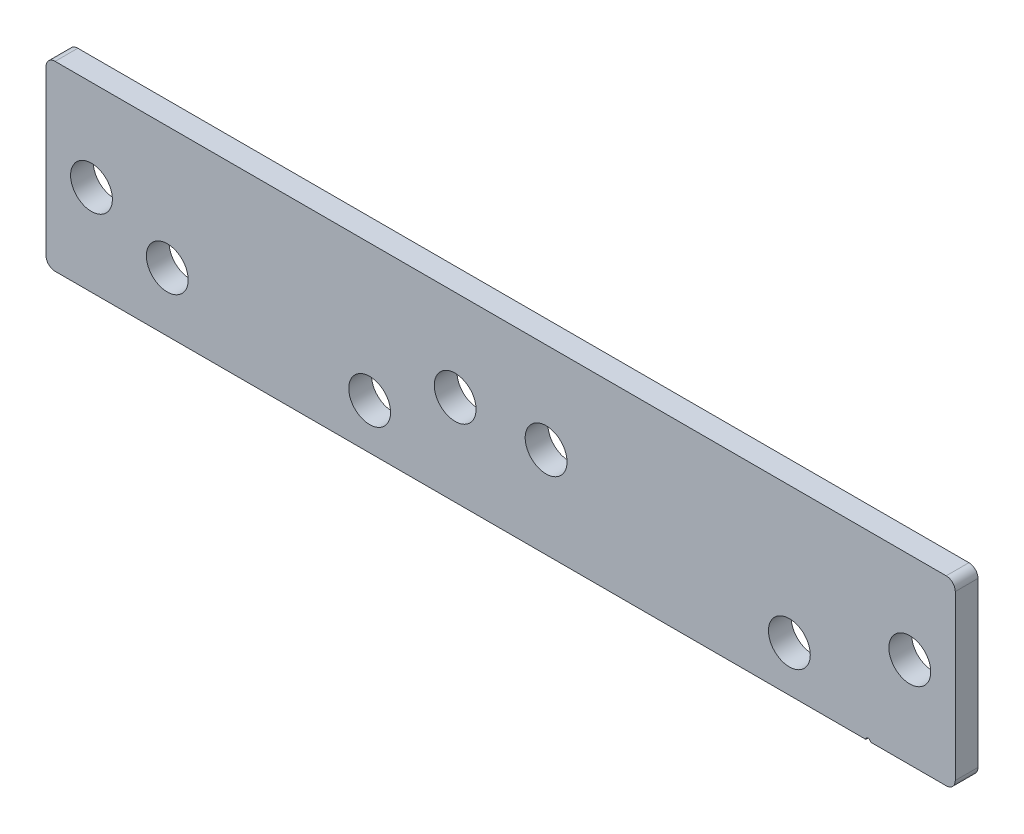
ISO-10303-21;
HEADER;
FILE_DESCRIPTION(('STEP AP214'),'2;1');
FILE_NAME('part.step','',(''),(''),'','','');
FILE_SCHEMA(('AUTOMOTIVE_DESIGN { 1 0 10303 214 1 1 1 1 }'));
ENDSEC;
DATA;
#1=APPLICATION_CONTEXT('core data for automotive mechanical design processes');
#2=APPLICATION_PROTOCOL_DEFINITION('international standard','automotive_design',2000,#1);
#3=PRODUCT_CONTEXT('',#1,'mechanical');
#4=PRODUCT('Part','Part','',(#3));
#5=PRODUCT_RELATED_PRODUCT_CATEGORY('part','',(#4));
#6=PRODUCT_DEFINITION_FORMATION('','',#4);
#7=PRODUCT_DEFINITION_CONTEXT('part definition',#1,'design');
#8=PRODUCT_DEFINITION('design','',#6,#7);
#9=PRODUCT_DEFINITION_SHAPE('','',#8);
#10=(LENGTH_UNIT() NAMED_UNIT(*) SI_UNIT(.MILLI.,.METRE.));
#11=(NAMED_UNIT(*) PLANE_ANGLE_UNIT() SI_UNIT($,.RADIAN.));
#12=(NAMED_UNIT(*) SI_UNIT($,.STERADIAN.) SOLID_ANGLE_UNIT());
#13=UNCERTAINTY_MEASURE_WITH_UNIT(LENGTH_MEASURE(1.E-05),#10,'distance_accuracy_value','');
#14=(GEOMETRIC_REPRESENTATION_CONTEXT(3) GLOBAL_UNCERTAINTY_ASSIGNED_CONTEXT((#13)) GLOBAL_UNIT_ASSIGNED_CONTEXT((#10,
#11,#12)) REPRESENTATION_CONTEXT('',''));
#15=CARTESIAN_POINT('',(0.,0.,0.));
#16=DIRECTION('',(0.,0.,1.));
#17=DIRECTION('',(1.,0.,0.));
#18=AXIS2_PLACEMENT_3D('',#15,#16,#17);
#19=CARTESIAN_POINT('',(-100.,-20.,5.));
#20=DIRECTION('',(0.,1.,0.));
#21=DIRECTION('',(-1.,0.,0.));
#22=AXIS2_PLACEMENT_3D('',#19,#20,#21);
#23=PLANE('',#22);
#24=DIRECTION('',(1.,0.,0.));
#25=VECTOR('',#24,1.);
#26=CARTESIAN_POINT('',(-100.,-20.,5.));
#27=LINE('',#26,#25);
#28=CARTESIAN_POINT('',(81.3290376865422,-20.,5.));
#29=VERTEX_POINT('',#28);
#30=CARTESIAN_POINT('',(98.,-19.9999999999999,5.));
#31=VERTEX_POINT('',#30);
#32=EDGE_CURVE('E41',#29,#31,#27,.T.);
#33=ORIENTED_EDGE('',*,*,#32,.F.);
#34=DIRECTION('',(0.,0.,-1.));
#35=VECTOR('',#34,1.);
#36=CARTESIAN_POINT('',(81.3290376865422,-20.,5.));
#37=LINE('',#36,#35);
#38=CARTESIAN_POINT('',(81.3290376865422,-20.,0.));
#39=VERTEX_POINT('',#38);
#40=EDGE_CURVE('E96',#29,#39,#37,.T.);
#41=ORIENTED_EDGE('',*,*,#40,.T.);
#42=DIRECTION('',(1.,0.,0.));
#43=VECTOR('',#42,1.);
#44=CARTESIAN_POINT('',(-100.,-20.,0.));
#45=LINE('',#44,#43);
#46=CARTESIAN_POINT('',(98.,-19.9999999999999,0.));
#47=VERTEX_POINT('',#46);
#48=EDGE_CURVE('E130',#39,#47,#45,.T.);
#49=ORIENTED_EDGE('',*,*,#48,.T.);
#50=DIRECTION('',(0.,0.,-1.));
#51=VECTOR('',#50,1.);
#52=CARTESIAN_POINT('',(98.,-19.9999999999999,5.));
#53=LINE('',#52,#51);
#54=EDGE_CURVE('E166',#47,#31,#53,.F.);
#55=ORIENTED_EDGE('',*,*,#54,.T.);
#56=EDGE_LOOP('',(#33,#41,#49,#55));
#57=FACE_BOUND('',#56,.T.);
#58=ADVANCED_FACE('F16',(#57),#23,.F.);
#59=CARTESIAN_POINT('',(-100.,20.,5.));
#60=DIRECTION('',(1.,0.,0.));
#61=DIRECTION('',(0.,1.,0.));
#62=AXIS2_PLACEMENT_3D('',#59,#60,#61);
#63=PLANE('',#62);
#64=DIRECTION('',(0.,-1.,0.));
#65=VECTOR('',#64,1.);
#66=CARTESIAN_POINT('',(-100.,20.,5.));
#67=LINE('',#66,#65);
#68=CARTESIAN_POINT('',(-100.,18.,5.));
#69=VERTEX_POINT('',#68);
#70=CARTESIAN_POINT('',(-100.,-18.,5.));
#71=VERTEX_POINT('',#70);
#72=EDGE_CURVE('E120',#69,#71,#67,.T.);
#73=ORIENTED_EDGE('',*,*,#72,.F.);
#74=DIRECTION('',(0.,0.,-1.));
#75=VECTOR('',#74,1.);
#76=CARTESIAN_POINT('',(-100.,18.,5.));
#77=LINE('',#76,#75);
#78=CARTESIAN_POINT('',(-100.,18.,0.));
#79=VERTEX_POINT('',#78);
#80=EDGE_CURVE('E10',#69,#79,#77,.T.);
#81=ORIENTED_EDGE('',*,*,#80,.T.);
#82=DIRECTION('',(0.,-1.,0.));
#83=VECTOR('',#82,1.);
#84=CARTESIAN_POINT('',(-100.,20.,0.));
#85=LINE('',#84,#83);
#86=CARTESIAN_POINT('',(-100.,-18.,0.));
#87=VERTEX_POINT('',#86);
#88=EDGE_CURVE('E127',#79,#87,#85,.T.);
#89=ORIENTED_EDGE('',*,*,#88,.T.);
#90=DIRECTION('',(0.,0.,-1.));
#91=VECTOR('',#90,1.);
#92=CARTESIAN_POINT('',(-100.,-18.,5.));
#93=LINE('',#92,#91);
#94=EDGE_CURVE('E25',#87,#71,#93,.F.);
#95=ORIENTED_EDGE('',*,*,#94,.T.);
#96=EDGE_LOOP('',(#73,#81,#89,#95));
#97=FACE_BOUND('',#96,.T.);
#98=ADVANCED_FACE('F244',(#97),#63,.F.);
#99=CARTESIAN_POINT('',(-98.,-20.,0.));
#100=VERTEX_POINT('',#99);
#101=CARTESIAN_POINT('',(80.3290376865422,-20.,0.));
#102=VERTEX_POINT('',#101);
#103=EDGE_CURVE('E108',#100,#102,#45,.T.);
#104=ORIENTED_EDGE('',*,*,#103,.T.);
#105=DIRECTION('',(0.,0.,-1.));
#106=VECTOR('',#105,1.);
#107=CARTESIAN_POINT('',(80.3290376865422,-20.,5.));
#108=LINE('',#107,#106);
#109=CARTESIAN_POINT('',(80.3290376865422,-20.,5.));
#110=VERTEX_POINT('',#109);
#111=EDGE_CURVE('E33',#102,#110,#108,.F.);
#112=ORIENTED_EDGE('',*,*,#111,.T.);
#113=CARTESIAN_POINT('',(-98.,-20.,5.));
#114=VERTEX_POINT('',#113);
#115=EDGE_CURVE('E105',#114,#110,#27,.T.);
#116=ORIENTED_EDGE('',*,*,#115,.F.);
#117=DIRECTION('',(0.,0.,-1.));
#118=VECTOR('',#117,1.);
#119=CARTESIAN_POINT('',(-98.,-20.,5.));
#120=LINE('',#119,#118);
#121=EDGE_CURVE('E164',#114,#100,#120,.T.);
#122=ORIENTED_EDGE('',*,*,#121,.T.);
#123=EDGE_LOOP('',(#104,#112,#116,#122));
#124=FACE_BOUND('',#123,.T.);
#125=ADVANCED_FACE('F103',(#124),#23,.F.);
#126=CARTESIAN_POINT('',(100.,20.,5.));
#127=DIRECTION('',(-1.,0.,0.));
#128=DIRECTION('',(0.,0.,1.));
#129=AXIS2_PLACEMENT_3D('',#126,#127,#128);
#130=PLANE('',#129);
#131=DIRECTION('',(0.,1.,0.));
#132=VECTOR('',#131,1.);
#133=CARTESIAN_POINT('',(100.,20.,0.));
#134=LINE('',#133,#132);
#135=CARTESIAN_POINT('',(100.,-18.,0.));
#136=VERTEX_POINT('',#135);
#137=CARTESIAN_POINT('',(100.,18.,0.));
#138=VERTEX_POINT('',#137);
#139=EDGE_CURVE('E133',#136,#138,#134,.T.);
#140=ORIENTED_EDGE('',*,*,#139,.T.);
#141=DIRECTION('',(0.,0.,-1.));
#142=VECTOR('',#141,1.);
#143=CARTESIAN_POINT('',(100.,18.,5.));
#144=LINE('',#143,#142);
#145=CARTESIAN_POINT('',(100.,18.,5.));
#146=VERTEX_POINT('',#145);
#147=EDGE_CURVE('E155',#138,#146,#144,.F.);
#148=ORIENTED_EDGE('',*,*,#147,.T.);
#149=DIRECTION('',(0.,1.,0.));
#150=VECTOR('',#149,1.);
#151=CARTESIAN_POINT('',(100.,20.,5.));
#152=LINE('',#151,#150);
#153=CARTESIAN_POINT('',(100.,-18.,5.));
#154=VERTEX_POINT('',#153);
#155=EDGE_CURVE('E115',#154,#146,#152,.T.);
#156=ORIENTED_EDGE('',*,*,#155,.F.);
#157=DIRECTION('',(0.,0.,-1.));
#158=VECTOR('',#157,1.);
#159=CARTESIAN_POINT('',(100.,-18.,5.));
#160=LINE('',#159,#158);
#161=EDGE_CURVE('E152',#154,#136,#160,.T.);
#162=ORIENTED_EDGE('',*,*,#161,.T.);
#163=EDGE_LOOP('',(#140,#148,#156,#162));
#164=FACE_BOUND('',#163,.T.);
#165=ADVANCED_FACE('F228',(#164),#130,.F.);
#166=CARTESIAN_POINT('',(-100.,20.,5.));
#167=DIRECTION('',(0.,-1.,0.));
#168=DIRECTION('',(1.,0.,0.));
#169=AXIS2_PLACEMENT_3D('',#166,#167,#168);
#170=PLANE('',#169);
#171=DIRECTION('',(-1.,0.,0.));
#172=VECTOR('',#171,1.);
#173=CARTESIAN_POINT('',(-100.,20.,5.));
#174=LINE('',#173,#172);
#175=CARTESIAN_POINT('',(98.,20.,5.));
#176=VERTEX_POINT('',#175);
#177=CARTESIAN_POINT('',(-98.,20.,5.));
#178=VERTEX_POINT('',#177);
#179=EDGE_CURVE('E118',#176,#178,#174,.T.);
#180=ORIENTED_EDGE('',*,*,#179,.F.);
#181=DIRECTION('',(0.,0.,-1.));
#182=VECTOR('',#181,1.);
#183=CARTESIAN_POINT('',(98.,20.,5.));
#184=LINE('',#183,#182);
#185=CARTESIAN_POINT('',(98.,20.,0.));
#186=VERTEX_POINT('',#185);
#187=EDGE_CURVE('E140',#176,#186,#184,.T.);
#188=ORIENTED_EDGE('',*,*,#187,.T.);
#189=DIRECTION('',(-1.,0.,0.));
#190=VECTOR('',#189,1.);
#191=CARTESIAN_POINT('',(-100.,20.,0.));
#192=LINE('',#191,#190);
#193=CARTESIAN_POINT('',(-98.,20.,0.));
#194=VERTEX_POINT('',#193);
#195=EDGE_CURVE('E136',#186,#194,#192,.T.);
#196=ORIENTED_EDGE('',*,*,#195,.T.);
#197=DIRECTION('',(0.,0.,-1.));
#198=VECTOR('',#197,1.);
#199=CARTESIAN_POINT('',(-98.,20.,5.));
#200=LINE('',#199,#198);
#201=EDGE_CURVE('E126',#194,#178,#200,.F.);
#202=ORIENTED_EDGE('',*,*,#201,.T.);
#203=EDGE_LOOP('',(#180,#188,#196,#202));
#204=FACE_BOUND('',#203,.T.);
#205=ADVANCED_FACE('F236',(#204),#170,.F.);
#206=CARTESIAN_POINT('',(0.,0.,5.));
#207=DIRECTION('',(0.,0.,1.));
#208=DIRECTION('',(1.,0.,0.));
#209=AXIS2_PLACEMENT_3D('',#206,#207,#208);
#210=PLANE('',#209);
#211=CARTESIAN_POINT('',(-9.99999999999999,0.,5.));
#212=DIRECTION('',(0.,0.,1.));
#213=DIRECTION('',(1.,0.,0.));
#214=AXIS2_PLACEMENT_3D('',#211,#212,#213);
#215=CIRCLE('',#214,4.6);
#216=CARTESIAN_POINT('',(-5.4,0.,5.));
#217=VERTEX_POINT('',#216);
#218=EDGE_CURVE('E176',#217,#217,#215,.T.);
#219=ORIENTED_EDGE('',*,*,#218,.F.);
#220=EDGE_LOOP('',(#219));
#221=FACE_BOUND('',#220,.T.);
#222=CARTESIAN_POINT('',(10.,0.,5.));
#223=DIRECTION('',(0.,0.,1.));
#224=DIRECTION('',(1.,0.,0.));
#225=AXIS2_PLACEMENT_3D('',#222,#223,#224);
#226=CIRCLE('',#225,4.6);
#227=CARTESIAN_POINT('',(14.6,0.,5.));
#228=VERTEX_POINT('',#227);
#229=EDGE_CURVE('E303',#228,#228,#226,.T.);
#230=ORIENTED_EDGE('',*,*,#229,.F.);
#231=EDGE_LOOP('',(#230));
#232=FACE_BOUND('',#231,.T.);
#233=CARTESIAN_POINT('',(90.,0.,5.));
#234=DIRECTION('',(0.,0.,1.));
#235=DIRECTION('',(1.,0.,0.));
#236=AXIS2_PLACEMENT_3D('',#233,#234,#235);
#237=CIRCLE('',#236,4.60000000000001);
#238=CARTESIAN_POINT('',(94.6,0.,5.));
#239=VERTEX_POINT('',#238);
#240=EDGE_CURVE('E188',#239,#239,#237,.T.);
#241=ORIENTED_EDGE('',*,*,#240,.F.);
#242=EDGE_LOOP('',(#241));
#243=FACE_BOUND('',#242,.T.);
#244=CARTESIAN_POINT('',(-90.,0.,5.));
#245=DIRECTION('',(0.,0.,1.));
#246=DIRECTION('',(1.,0.,0.));
#247=AXIS2_PLACEMENT_3D('',#244,#245,#246);
#248=CIRCLE('',#247,4.6);
#249=CARTESIAN_POINT('',(-85.4,0.,5.));
#250=VERTEX_POINT('',#249);
#251=EDGE_CURVE('E172',#250,#250,#248,.T.);
#252=ORIENTED_EDGE('',*,*,#251,.F.);
#253=EDGE_LOOP('',(#252));
#254=FACE_BOUND('',#253,.T.);
#255=CARTESIAN_POINT('',(80.8290376865422,-20.,5.));
#256=DIRECTION('',(0.,0.,-1.));
#257=DIRECTION('',(-1.,0.,0.));
#258=AXIS2_PLACEMENT_3D('',#255,#256,#257);
#259=CIRCLE('',#258,0.499999999999999);
#260=EDGE_CURVE('E93',#110,#29,#259,.T.);
#261=ORIENTED_EDGE('',*,*,#260,.T.);
#262=ORIENTED_EDGE('',*,*,#32,.T.);
#263=CARTESIAN_POINT('',(98.,-18.,5.));
#264=DIRECTION('',(0.,0.,1.));
#265=DIRECTION('',(1.,0.,0.));
#266=AXIS2_PLACEMENT_3D('',#263,#264,#265);
#267=CIRCLE('',#266,2.);
#268=EDGE_CURVE('E160',#31,#154,#267,.T.);
#269=ORIENTED_EDGE('',*,*,#268,.T.);
#270=ORIENTED_EDGE('',*,*,#155,.T.);
#271=CARTESIAN_POINT('',(98.,18.,5.));
#272=DIRECTION('',(0.,0.,1.));
#273=DIRECTION('',(1.,0.,0.));
#274=AXIS2_PLACEMENT_3D('',#271,#272,#273);
#275=CIRCLE('',#274,2.);
#276=EDGE_CURVE('E162',#146,#176,#275,.T.);
#277=ORIENTED_EDGE('',*,*,#276,.T.);
#278=ORIENTED_EDGE('',*,*,#179,.T.);
#279=CARTESIAN_POINT('',(-98.,18.,5.));
#280=DIRECTION('',(0.,0.,1.));
#281=DIRECTION('',(1.,0.,0.));
#282=AXIS2_PLACEMENT_3D('',#279,#280,#281);
#283=CIRCLE('',#282,2.);
#284=EDGE_CURVE('E158',#178,#69,#283,.T.);
#285=ORIENTED_EDGE('',*,*,#284,.T.);
#286=ORIENTED_EDGE('',*,*,#72,.T.);
#287=CARTESIAN_POINT('',(-98.,-18.,5.));
#288=DIRECTION('',(0.,0.,1.));
#289=DIRECTION('',(1.,0.,0.));
#290=AXIS2_PLACEMENT_3D('',#287,#288,#289);
#291=CIRCLE('',#290,2.);
#292=EDGE_CURVE('E114',#71,#114,#291,.T.);
#293=ORIENTED_EDGE('',*,*,#292,.T.);
#294=ORIENTED_EDGE('',*,*,#115,.T.);
#295=EDGE_LOOP('',(#261,#262,#269,#270,#277,#278,#285,#286,#293,#294));
#296=FACE_BOUND('',#295,.T.);
#297=CARTESIAN_POINT('',(63.5085296108533,-10.,5.));
#298=DIRECTION('',(0.,0.,1.));
#299=DIRECTION('',(1.,0.,0.));
#300=AXIS2_PLACEMENT_3D('',#297,#298,#299);
#301=CIRCLE('',#300,4.60000000000001);
#302=CARTESIAN_POINT('',(68.1085296108533,-10.,5.));
#303=VERTEX_POINT('',#302);
#304=EDGE_CURVE('E194',#303,#303,#301,.T.);
#305=ORIENTED_EDGE('',*,*,#304,.F.);
#306=EDGE_LOOP('',(#305));
#307=FACE_BOUND('',#306,.T.);
#308=CARTESIAN_POINT('',(-28.8062077539679,-10.,5.));
#309=DIRECTION('',(0.,0.,1.));
#310=DIRECTION('',(1.,0.,0.));
#311=AXIS2_PLACEMENT_3D('',#308,#309,#310);
#312=CIRCLE('',#311,4.6);
#313=CARTESIAN_POINT('',(-24.2062077539679,-10.,5.));
#314=VERTEX_POINT('',#313);
#315=EDGE_CURVE('E193',#314,#314,#312,.T.);
#316=ORIENTED_EDGE('',*,*,#315,.F.);
#317=EDGE_LOOP('',(#316));
#318=FACE_BOUND('',#317,.T.);
#319=CARTESIAN_POINT('',(-73.3234841870881,-7.00000000000003,5.));
#320=DIRECTION('',(0.,0.,1.));
#321=DIRECTION('',(1.,0.,0.));
#322=AXIS2_PLACEMENT_3D('',#319,#320,#321);
#323=CIRCLE('',#322,4.6);
#324=CARTESIAN_POINT('',(-68.7234841870881,-7.00000000000003,5.));
#325=VERTEX_POINT('',#324);
#326=EDGE_CURVE('E201',#325,#325,#323,.T.);
#327=ORIENTED_EDGE('',*,*,#326,.F.);
#328=EDGE_LOOP('',(#327));
#329=FACE_BOUND('',#328,.T.);
#330=ADVANCED_FACE('F110',(#221,#232,#243,#254,#296,#307,#318,#329),#210,.T.);
#331=CARTESIAN_POINT('',(0.,0.,0.));
#332=DIRECTION('',(0.,0.,1.));
#333=DIRECTION('',(1.,0.,0.));
#334=AXIS2_PLACEMENT_3D('',#331,#332,#333);
#335=PLANE('',#334);
#336=CARTESIAN_POINT('',(-9.99999999999999,0.,0.));
#337=DIRECTION('',(0.,0.,1.));
#338=DIRECTION('',(1.,0.,0.));
#339=AXIS2_PLACEMENT_3D('',#336,#337,#338);
#340=CIRCLE('',#339,4.6);
#341=CARTESIAN_POINT('',(-5.4,0.,0.));
#342=VERTEX_POINT('',#341);
#343=EDGE_CURVE('E20',#342,#342,#340,.T.);
#344=ORIENTED_EDGE('',*,*,#343,.T.);
#345=EDGE_LOOP('',(#344));
#346=FACE_BOUND('',#345,.T.);
#347=CARTESIAN_POINT('',(10.,0.,0.));
#348=DIRECTION('',(0.,0.,1.));
#349=DIRECTION('',(1.,0.,0.));
#350=AXIS2_PLACEMENT_3D('',#347,#348,#349);
#351=CIRCLE('',#350,4.6);
#352=CARTESIAN_POINT('',(14.6,0.,0.));
#353=VERTEX_POINT('',#352);
#354=EDGE_CURVE('E175',#353,#353,#351,.T.);
#355=ORIENTED_EDGE('',*,*,#354,.T.);
#356=EDGE_LOOP('',(#355));
#357=FACE_BOUND('',#356,.T.);
#358=CARTESIAN_POINT('',(90.,0.,0.));
#359=DIRECTION('',(0.,0.,1.));
#360=DIRECTION('',(1.,0.,0.));
#361=AXIS2_PLACEMENT_3D('',#358,#359,#360);
#362=CIRCLE('',#361,4.60000000000001);
#363=CARTESIAN_POINT('',(94.6,0.,0.));
#364=VERTEX_POINT('',#363);
#365=EDGE_CURVE('E173',#364,#364,#362,.T.);
#366=ORIENTED_EDGE('',*,*,#365,.T.);
#367=EDGE_LOOP('',(#366));
#368=FACE_BOUND('',#367,.T.);
#369=CARTESIAN_POINT('',(-90.,0.,0.));
#370=DIRECTION('',(0.,0.,1.));
#371=DIRECTION('',(1.,0.,0.));
#372=AXIS2_PLACEMENT_3D('',#369,#370,#371);
#373=CIRCLE('',#372,4.6);
#374=CARTESIAN_POINT('',(-85.4,0.,0.));
#375=VERTEX_POINT('',#374);
#376=EDGE_CURVE('E169',#375,#375,#373,.T.);
#377=ORIENTED_EDGE('',*,*,#376,.T.);
#378=EDGE_LOOP('',(#377));
#379=FACE_BOUND('',#378,.T.);
#380=CARTESIAN_POINT('',(63.5085296108533,-10.,0.));
#381=DIRECTION('',(0.,0.,1.));
#382=DIRECTION('',(1.,0.,0.));
#383=AXIS2_PLACEMENT_3D('',#380,#381,#382);
#384=CIRCLE('',#383,4.60000000000001);
#385=CARTESIAN_POINT('',(68.1085296108533,-10.,0.));
#386=VERTEX_POINT('',#385);
#387=EDGE_CURVE('E197',#386,#386,#384,.F.);
#388=ORIENTED_EDGE('',*,*,#387,.F.);
#389=EDGE_LOOP('',(#388));
#390=FACE_BOUND('',#389,.T.);
#391=CARTESIAN_POINT('',(-28.8062077539679,-10.,0.));
#392=DIRECTION('',(0.,0.,1.));
#393=DIRECTION('',(1.,0.,0.));
#394=AXIS2_PLACEMENT_3D('',#391,#392,#393);
#395=CIRCLE('',#394,4.6);
#396=CARTESIAN_POINT('',(-24.2062077539679,-10.,0.));
#397=VERTEX_POINT('',#396);
#398=EDGE_CURVE('E198',#397,#397,#395,.F.);
#399=ORIENTED_EDGE('',*,*,#398,.F.);
#400=EDGE_LOOP('',(#399));
#401=FACE_BOUND('',#400,.T.);
#402=CARTESIAN_POINT('',(-73.3234841870881,-7.00000000000003,0.));
#403=DIRECTION('',(0.,0.,1.));
#404=DIRECTION('',(1.,0.,0.));
#405=AXIS2_PLACEMENT_3D('',#402,#403,#404);
#406=CIRCLE('',#405,4.6);
#407=CARTESIAN_POINT('',(-68.7234841870881,-7.00000000000003,0.));
#408=VERTEX_POINT('',#407);
#409=EDGE_CURVE('E131',#408,#408,#406,.F.);
#410=ORIENTED_EDGE('',*,*,#409,.F.);
#411=EDGE_LOOP('',(#410));
#412=FACE_BOUND('',#411,.T.);
#413=ORIENTED_EDGE('',*,*,#48,.F.);
#414=CARTESIAN_POINT('',(80.8290376865422,-20.,0.));
#415=DIRECTION('',(0.,0.,-1.));
#416=DIRECTION('',(-1.,0.,0.));
#417=AXIS2_PLACEMENT_3D('',#414,#415,#416);
#418=CIRCLE('',#417,0.499999999999999);
#419=EDGE_CURVE('E98',#102,#39,#418,.T.);
#420=ORIENTED_EDGE('',*,*,#419,.F.);
#421=ORIENTED_EDGE('',*,*,#103,.F.);
#422=CARTESIAN_POINT('',(-98.,-18.,0.));
#423=DIRECTION('',(0.,0.,1.));
#424=DIRECTION('',(1.,0.,0.));
#425=AXIS2_PLACEMENT_3D('',#422,#423,#424);
#426=CIRCLE('',#425,2.);
#427=EDGE_CURVE('E143',#100,#87,#426,.F.);
#428=ORIENTED_EDGE('',*,*,#427,.T.);
#429=ORIENTED_EDGE('',*,*,#88,.F.);
#430=CARTESIAN_POINT('',(-98.,18.,0.));
#431=DIRECTION('',(0.,0.,1.));
#432=DIRECTION('',(1.,0.,0.));
#433=AXIS2_PLACEMENT_3D('',#430,#431,#432);
#434=CIRCLE('',#433,2.);
#435=EDGE_CURVE('E145',#79,#194,#434,.F.);
#436=ORIENTED_EDGE('',*,*,#435,.T.);
#437=ORIENTED_EDGE('',*,*,#195,.F.);
#438=CARTESIAN_POINT('',(98.,18.,0.));
#439=DIRECTION('',(0.,0.,1.));
#440=DIRECTION('',(1.,0.,0.));
#441=AXIS2_PLACEMENT_3D('',#438,#439,#440);
#442=CIRCLE('',#441,2.);
#443=EDGE_CURVE('E150',#186,#138,#442,.F.);
#444=ORIENTED_EDGE('',*,*,#443,.T.);
#445=ORIENTED_EDGE('',*,*,#139,.F.);
#446=CARTESIAN_POINT('',(98.,-18.,0.));
#447=DIRECTION('',(0.,0.,1.));
#448=DIRECTION('',(1.,0.,0.));
#449=AXIS2_PLACEMENT_3D('',#446,#447,#448);
#450=CIRCLE('',#449,2.);
#451=EDGE_CURVE('E147',#136,#47,#450,.F.);
#452=ORIENTED_EDGE('',*,*,#451,.T.);
#453=EDGE_LOOP('',(#413,#420,#421,#428,#429,#436,#437,#444,#445,#452));
#454=FACE_BOUND('',#453,.T.);
#455=ADVANCED_FACE('F213',(#346,#357,#368,#379,#390,#401,#412,#454),#335,.F.);
#456=CARTESIAN_POINT('',(-73.3234841870881,-7.00000000000003,-13.0107647738325));
#457=DIRECTION('',(0.,0.,1.));
#458=DIRECTION('',(1.,0.,0.));
#459=AXIS2_PLACEMENT_3D('',#456,#457,#458);
#460=CYLINDRICAL_SURFACE('',#459,4.6);
#461=ORIENTED_EDGE('',*,*,#409,.T.);
#462=EDGE_LOOP('',(#461));
#463=FACE_BOUND('',#462,.T.);
#464=ORIENTED_EDGE('',*,*,#326,.T.);
#465=EDGE_LOOP('',(#464));
#466=FACE_BOUND('',#465,.T.);
#467=ADVANCED_FACE('F210',(#463,#466),#460,.F.);
#468=CARTESIAN_POINT('',(-28.8062077539679,-10.,-13.0107647738325));
#469=DIRECTION('',(0.,0.,1.));
#470=DIRECTION('',(1.,0.,0.));
#471=AXIS2_PLACEMENT_3D('',#468,#469,#470);
#472=CYLINDRICAL_SURFACE('',#471,4.6);
#473=ORIENTED_EDGE('',*,*,#398,.T.);
#474=EDGE_LOOP('',(#473));
#475=FACE_BOUND('',#474,.T.);
#476=ORIENTED_EDGE('',*,*,#315,.T.);
#477=EDGE_LOOP('',(#476));
#478=FACE_BOUND('',#477,.T.);
#479=ADVANCED_FACE('F277',(#475,#478),#472,.F.);
#480=CARTESIAN_POINT('',(63.5085296108533,-10.,-13.0107647738325));
#481=DIRECTION('',(0.,0.,1.));
#482=DIRECTION('',(1.,0.,0.));
#483=AXIS2_PLACEMENT_3D('',#480,#481,#482);
#484=CYLINDRICAL_SURFACE('',#483,4.60000000000001);
#485=ORIENTED_EDGE('',*,*,#387,.T.);
#486=EDGE_LOOP('',(#485));
#487=FACE_BOUND('',#486,.T.);
#488=ORIENTED_EDGE('',*,*,#304,.T.);
#489=EDGE_LOOP('',(#488));
#490=FACE_BOUND('',#489,.T.);
#491=ADVANCED_FACE('F280',(#487,#490),#484,.F.);
#492=CARTESIAN_POINT('',(98.,18.,5.));
#493=DIRECTION('',(0.,0.,-1.));
#494=DIRECTION('',(-1.,0.,0.));
#495=AXIS2_PLACEMENT_3D('',#492,#493,#494);
#496=CYLINDRICAL_SURFACE('',#495,2.);
#497=ORIENTED_EDGE('',*,*,#276,.F.);
#498=ORIENTED_EDGE('',*,*,#147,.F.);
#499=ORIENTED_EDGE('',*,*,#443,.F.);
#500=ORIENTED_EDGE('',*,*,#187,.F.);
#501=EDGE_LOOP('',(#497,#498,#499,#500));
#502=FACE_BOUND('',#501,.T.);
#503=ADVANCED_FACE('F231',(#502),#496,.T.);
#504=CARTESIAN_POINT('',(98.,-18.,5.));
#505=DIRECTION('',(0.,0.,-1.));
#506=DIRECTION('',(-1.,0.,0.));
#507=AXIS2_PLACEMENT_3D('',#504,#505,#506);
#508=CYLINDRICAL_SURFACE('',#507,2.);
#509=ORIENTED_EDGE('',*,*,#268,.F.);
#510=ORIENTED_EDGE('',*,*,#54,.F.);
#511=ORIENTED_EDGE('',*,*,#451,.F.);
#512=ORIENTED_EDGE('',*,*,#161,.F.);
#513=EDGE_LOOP('',(#509,#510,#511,#512));
#514=FACE_BOUND('',#513,.T.);
#515=ADVANCED_FACE('F224',(#514),#508,.T.);
#516=CARTESIAN_POINT('',(-98.,18.,5.));
#517=DIRECTION('',(0.,0.,-1.));
#518=DIRECTION('',(-1.,0.,0.));
#519=AXIS2_PLACEMENT_3D('',#516,#517,#518);
#520=CYLINDRICAL_SURFACE('',#519,2.);
#521=ORIENTED_EDGE('',*,*,#284,.F.);
#522=ORIENTED_EDGE('',*,*,#201,.F.);
#523=ORIENTED_EDGE('',*,*,#435,.F.);
#524=ORIENTED_EDGE('',*,*,#80,.F.);
#525=EDGE_LOOP('',(#521,#522,#523,#524));
#526=FACE_BOUND('',#525,.T.);
#527=ADVANCED_FACE('F240',(#526),#520,.T.);
#528=CARTESIAN_POINT('',(-98.,-18.,5.));
#529=DIRECTION('',(0.,0.,-1.));
#530=DIRECTION('',(-1.,0.,0.));
#531=AXIS2_PLACEMENT_3D('',#528,#529,#530);
#532=CYLINDRICAL_SURFACE('',#531,2.);
#533=ORIENTED_EDGE('',*,*,#292,.F.);
#534=ORIENTED_EDGE('',*,*,#94,.F.);
#535=ORIENTED_EDGE('',*,*,#427,.F.);
#536=ORIENTED_EDGE('',*,*,#121,.F.);
#537=EDGE_LOOP('',(#533,#534,#535,#536));
#538=FACE_BOUND('',#537,.T.);
#539=ADVANCED_FACE('F18',(#538),#532,.T.);
#540=CARTESIAN_POINT('',(80.8290376865422,-20.,5.));
#541=DIRECTION('',(0.,0.,-1.));
#542=DIRECTION('',(-1.,0.,0.));
#543=AXIS2_PLACEMENT_3D('',#540,#541,#542);
#544=CYLINDRICAL_SURFACE('',#543,0.499999999999999);
#545=ORIENTED_EDGE('',*,*,#260,.F.);
#546=ORIENTED_EDGE('',*,*,#111,.F.);
#547=ORIENTED_EDGE('',*,*,#419,.T.);
#548=ORIENTED_EDGE('',*,*,#40,.F.);
#549=EDGE_LOOP('',(#545,#546,#547,#548));
#550=FACE_BOUND('',#549,.T.);
#551=ADVANCED_FACE('F94',(#550),#544,.F.);
#552=CARTESIAN_POINT('',(-90.,0.,-5.));
#553=DIRECTION('',(0.,0.,1.));
#554=DIRECTION('',(1.,0.,0.));
#555=AXIS2_PLACEMENT_3D('',#552,#553,#554);
#556=CYLINDRICAL_SURFACE('',#555,4.6);
#557=ORIENTED_EDGE('',*,*,#251,.T.);
#558=EDGE_LOOP('',(#557));
#559=FACE_BOUND('',#558,.T.);
#560=ORIENTED_EDGE('',*,*,#376,.F.);
#561=EDGE_LOOP('',(#560));
#562=FACE_BOUND('',#561,.T.);
#563=ADVANCED_FACE('F254',(#559,#562),#556,.F.);
#564=CARTESIAN_POINT('',(90.,0.,-5.));
#565=DIRECTION('',(0.,0.,1.));
#566=DIRECTION('',(1.,0.,0.));
#567=AXIS2_PLACEMENT_3D('',#564,#565,#566);
#568=CYLINDRICAL_SURFACE('',#567,4.60000000000001);
#569=ORIENTED_EDGE('',*,*,#240,.T.);
#570=EDGE_LOOP('',(#569));
#571=FACE_BOUND('',#570,.T.);
#572=ORIENTED_EDGE('',*,*,#365,.F.);
#573=EDGE_LOOP('',(#572));
#574=FACE_BOUND('',#573,.T.);
#575=ADVANCED_FACE('F287',(#571,#574),#568,.F.);
#576=CARTESIAN_POINT('',(10.,0.,-5.));
#577=DIRECTION('',(0.,0.,1.));
#578=DIRECTION('',(1.,0.,0.));
#579=AXIS2_PLACEMENT_3D('',#576,#577,#578);
#580=CYLINDRICAL_SURFACE('',#579,4.6);
#581=ORIENTED_EDGE('',*,*,#229,.T.);
#582=EDGE_LOOP('',(#581));
#583=FACE_BOUND('',#582,.T.);
#584=ORIENTED_EDGE('',*,*,#354,.F.);
#585=EDGE_LOOP('',(#584));
#586=FACE_BOUND('',#585,.T.);
#587=ADVANCED_FACE('F290',(#583,#586),#580,.F.);
#588=CARTESIAN_POINT('',(-9.99999999999999,0.,-5.));
#589=DIRECTION('',(0.,0.,1.));
#590=DIRECTION('',(1.,0.,0.));
#591=AXIS2_PLACEMENT_3D('',#588,#589,#590);
#592=CYLINDRICAL_SURFACE('',#591,4.6);
#593=ORIENTED_EDGE('',*,*,#218,.T.);
#594=EDGE_LOOP('',(#593));
#595=FACE_BOUND('',#594,.T.);
#596=ORIENTED_EDGE('',*,*,#343,.F.);
#597=EDGE_LOOP('',(#596));
#598=FACE_BOUND('',#597,.T.);
#599=ADVANCED_FACE('F294',(#595,#598),#592,.F.);
#600=CLOSED_SHELL('',(#58,#98,#125,#165,#205,#330,#455,#467,#479,#491,#503,#515,#527,#539,#551,
#563,#575,#587,#599));
#601=MANIFOLD_SOLID_BREP('B1',#600);
#602=ADVANCED_BREP_SHAPE_REPRESENTATION('',(#18,#601),#14);
#603=SHAPE_DEFINITION_REPRESENTATION(#9,#602);
ENDSEC;
END-ISO-10303-21;
